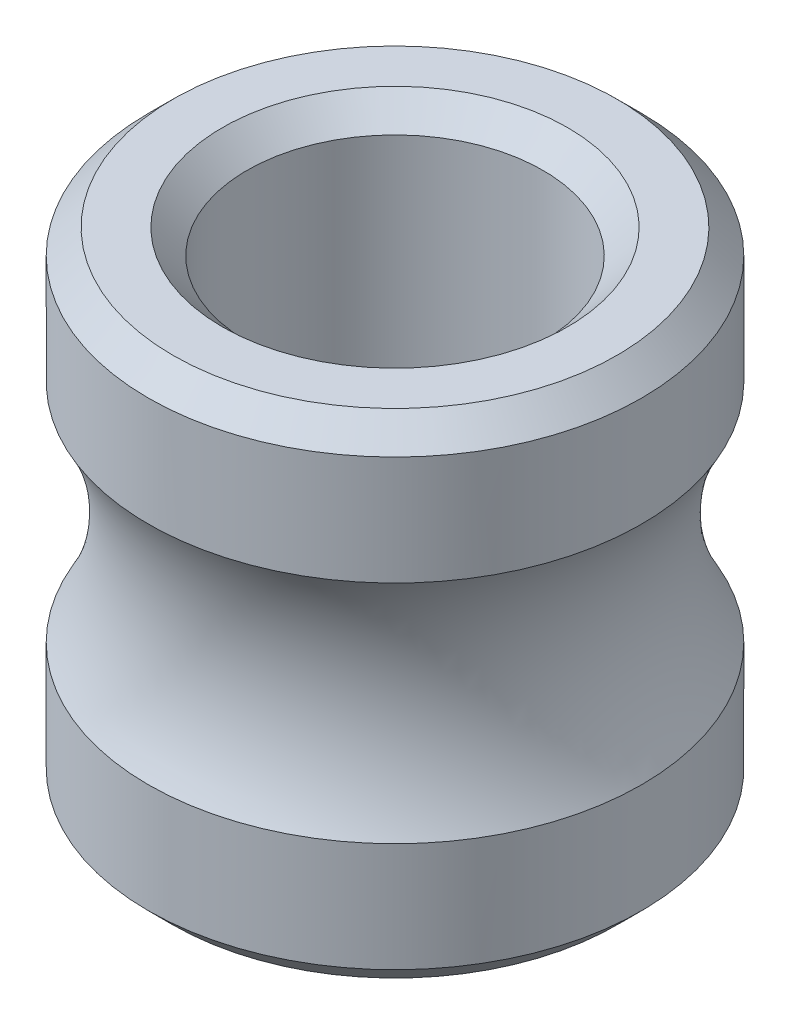
ISO-10303-21;
HEADER;
FILE_DESCRIPTION(('STEP AP214'),'2;1');
FILE_NAME('part.step','',(''),(''),'','','');
FILE_SCHEMA(('AUTOMOTIVE_DESIGN { 1 0 10303 214 1 1 1 1 }'));
ENDSEC;
DATA;
#1=APPLICATION_CONTEXT('core data for automotive mechanical design processes');
#2=APPLICATION_PROTOCOL_DEFINITION('international standard','automotive_design',2000,#1);
#3=PRODUCT_CONTEXT('',#1,'mechanical');
#4=PRODUCT('Part','Part','',(#3));
#5=PRODUCT_RELATED_PRODUCT_CATEGORY('part','',(#4));
#6=PRODUCT_DEFINITION_FORMATION('','',#4);
#7=PRODUCT_DEFINITION_CONTEXT('part definition',#1,'design');
#8=PRODUCT_DEFINITION('design','',#6,#7);
#9=PRODUCT_DEFINITION_SHAPE('','',#8);
#10=(LENGTH_UNIT() NAMED_UNIT(*) SI_UNIT(.MILLI.,.METRE.));
#11=(NAMED_UNIT(*) PLANE_ANGLE_UNIT() SI_UNIT($,.RADIAN.));
#12=(NAMED_UNIT(*) SI_UNIT($,.STERADIAN.) SOLID_ANGLE_UNIT());
#13=UNCERTAINTY_MEASURE_WITH_UNIT(LENGTH_MEASURE(1.E-05),#10,'distance_accuracy_value','');
#14=(GEOMETRIC_REPRESENTATION_CONTEXT(3) GLOBAL_UNCERTAINTY_ASSIGNED_CONTEXT((#13)) GLOBAL_UNIT_ASSIGNED_CONTEXT((#10,
#11,#12)) REPRESENTATION_CONTEXT('',''));
#15=CARTESIAN_POINT('',(0.,0.,0.));
#16=DIRECTION('',(0.,0.,1.));
#17=DIRECTION('',(1.,0.,0.));
#18=AXIS2_PLACEMENT_3D('',#15,#16,#17);
#19=CARTESIAN_POINT('',(0.,2.,0.));
#20=DIRECTION('',(0.,-1.,0.));
#21=DIRECTION('',(0.,0.,-1.));
#22=AXIS2_PLACEMENT_3D('',#19,#20,#21);
#23=CYLINDRICAL_SURFACE('',#22,2.);
#24=CARTESIAN_POINT('',(0.,-0.915150260886157,0.));
#25=DIRECTION('',(0.,1.,0.));
#26=DIRECTION('',(0.,0.,1.));
#27=AXIS2_PLACEMENT_3D('',#24,#25,#26);
#28=CIRCLE('',#27,2.);
#29=CARTESIAN_POINT('',(0.,-0.915150260886157,2.));
#30=VERTEX_POINT('',#29);
#31=EDGE_CURVE('E36',#30,#30,#28,.F.);
#32=ORIENTED_EDGE('',*,*,#31,.T.);
#33=EDGE_LOOP('',(#32));
#34=FACE_BOUND('',#33,.T.);
#35=CARTESIAN_POINT('',(0.,-1.8,0.));
#36=DIRECTION('',(0.,1.,0.));
#37=DIRECTION('',(0.,0.,1.));
#38=AXIS2_PLACEMENT_3D('',#35,#36,#37);
#39=CIRCLE('',#38,2.);
#40=CARTESIAN_POINT('',(0.,-1.8,2.));
#41=VERTEX_POINT('',#40);
#42=EDGE_CURVE('E45',#41,#41,#39,.T.);
#43=ORIENTED_EDGE('',*,*,#42,.T.);
#44=EDGE_LOOP('',(#43));
#45=FACE_BOUND('',#44,.T.);
#46=ADVANCED_FACE('F32',(#34,#45),#23,.T.);
#47=CARTESIAN_POINT('',(0.,2.,0.));
#48=DIRECTION('',(0.,1.,0.));
#49=DIRECTION('',(0.,0.,1.));
#50=AXIS2_PLACEMENT_3D('',#47,#48,#49);
#51=PLANE('',#50);
#52=CARTESIAN_POINT('',(0.,2.,0.));
#53=DIRECTION('',(0.,1.,0.));
#54=DIRECTION('',(0.,0.,1.));
#55=AXIS2_PLACEMENT_3D('',#52,#53,#54);
#56=CIRCLE('',#55,1.8);
#57=CARTESIAN_POINT('',(0.,2.,1.8));
#58=VERTEX_POINT('',#57);
#59=EDGE_CURVE('E10',#58,#58,#56,.T.);
#60=ORIENTED_EDGE('',*,*,#59,.T.);
#61=EDGE_LOOP('',(#60));
#62=FACE_BOUND('',#61,.T.);
#63=CARTESIAN_POINT('',(0.,2.,0.));
#64=DIRECTION('',(0.,1.,0.));
#65=DIRECTION('',(0.,0.,1.));
#66=AXIS2_PLACEMENT_3D('',#63,#64,#65);
#67=CIRCLE('',#66,1.4);
#68=CARTESIAN_POINT('',(0.,2.,1.4));
#69=VERTEX_POINT('',#68);
#70=EDGE_CURVE('E40',#69,#69,#67,.F.);
#71=ORIENTED_EDGE('',*,*,#70,.T.);
#72=EDGE_LOOP('',(#71));
#73=FACE_BOUND('',#72,.T.);
#74=ADVANCED_FACE('F91',(#62,#73),#51,.T.);
#75=CARTESIAN_POINT('',(0.,-2.,0.));
#76=DIRECTION('',(0.,1.,0.));
#77=DIRECTION('',(0.,0.,1.));
#78=AXIS2_PLACEMENT_3D('',#75,#76,#77);
#79=PLANE('',#78);
#80=CARTESIAN_POINT('',(0.,-2.,0.));
#81=DIRECTION('',(0.,1.,0.));
#82=DIRECTION('',(0.,0.,1.));
#83=AXIS2_PLACEMENT_3D('',#80,#81,#82);
#84=CIRCLE('',#83,1.4);
#85=CARTESIAN_POINT('',(0.,-2.,1.4));
#86=VERTEX_POINT('',#85);
#87=EDGE_CURVE('E57',#86,#86,#84,.T.);
#88=ORIENTED_EDGE('',*,*,#87,.T.);
#89=EDGE_LOOP('',(#88));
#90=FACE_BOUND('',#89,.T.);
#91=CARTESIAN_POINT('',(0.,-2.,0.));
#92=DIRECTION('',(0.,1.,0.));
#93=DIRECTION('',(0.,0.,1.));
#94=AXIS2_PLACEMENT_3D('',#91,#92,#93);
#95=CIRCLE('',#94,1.8);
#96=CARTESIAN_POINT('',(0.,-2.,1.8));
#97=VERTEX_POINT('',#96);
#98=EDGE_CURVE('E53',#97,#97,#95,.F.);
#99=ORIENTED_EDGE('',*,*,#98,.T.);
#100=EDGE_LOOP('',(#99));
#101=FACE_BOUND('',#100,.T.);
#102=ADVANCED_FACE('F97',(#90,#101),#79,.F.);
#103=CARTESIAN_POINT('',(0.,0.915150260886157,0.));
#104=DIRECTION('',(0.,-1.,0.));
#105=DIRECTION('',(0.,0.,-1.));
#106=AXIS2_PLACEMENT_3D('',#103,#104,#105);
#107=CIRCLE('',#106,2.);
#108=CARTESIAN_POINT('',(0.,0.915150260886157,-2.));
#109=VERTEX_POINT('',#108);
#110=EDGE_CURVE('E48',#109,#109,#107,.F.);
#111=ORIENTED_EDGE('',*,*,#110,.T.);
#112=EDGE_LOOP('',(#111));
#113=FACE_BOUND('',#112,.T.);
#114=CARTESIAN_POINT('',(0.,1.8,0.));
#115=DIRECTION('',(0.,1.,0.));
#116=DIRECTION('',(0.,0.,1.));
#117=AXIS2_PLACEMENT_3D('',#114,#115,#116);
#118=CIRCLE('',#117,2.);
#119=CARTESIAN_POINT('',(0.,1.8,2.));
#120=VERTEX_POINT('',#119);
#121=EDGE_CURVE('E70',#120,#120,#118,.F.);
#122=ORIENTED_EDGE('',*,*,#121,.T.);
#123=EDGE_LOOP('',(#122));
#124=FACE_BOUND('',#123,.T.);
#125=ADVANCED_FACE('F93',(#113,#124),#23,.T.);
#126=CARTESIAN_POINT('',(0.,2.,0.));
#127=DIRECTION('',(0.,-1.,0.));
#128=DIRECTION('',(0.,0.,-1.));
#129=AXIS2_PLACEMENT_3D('',#126,#127,#128);
#130=CYLINDRICAL_SURFACE('',#129,1.2);
#131=CARTESIAN_POINT('',(0.,-1.8,0.));
#132=DIRECTION('',(0.,1.,0.));
#133=DIRECTION('',(0.,0.,1.));
#134=AXIS2_PLACEMENT_3D('',#131,#132,#133);
#135=CIRCLE('',#134,1.2);
#136=CARTESIAN_POINT('',(0.,-1.8,1.2));
#137=VERTEX_POINT('',#136);
#138=EDGE_CURVE('E67',#137,#137,#135,.F.);
#139=ORIENTED_EDGE('',*,*,#138,.T.);
#140=EDGE_LOOP('',(#139));
#141=FACE_BOUND('',#140,.T.);
#142=CARTESIAN_POINT('',(0.,1.8,0.));
#143=DIRECTION('',(0.,1.,0.));
#144=DIRECTION('',(0.,0.,1.));
#145=AXIS2_PLACEMENT_3D('',#142,#143,#144);
#146=CIRCLE('',#145,1.2);
#147=CARTESIAN_POINT('',(0.,1.8,1.2));
#148=VERTEX_POINT('',#147);
#149=EDGE_CURVE('E62',#148,#148,#146,.T.);
#150=ORIENTED_EDGE('',*,*,#149,.T.);
#151=EDGE_LOOP('',(#150));
#152=FACE_BOUND('',#151,.T.);
#153=ADVANCED_FACE('F87',(#141,#152),#130,.F.);
#154=CARTESIAN_POINT('',(0.,-2.,0.));
#155=DIRECTION('',(0.,-1.,0.));
#156=DIRECTION('',(0.,0.,-1.));
#157=AXIS2_PLACEMENT_3D('',#154,#155,#156);
#158=CONICAL_SURFACE('',#157,1.4,0.785398163397447);
#159=ORIENTED_EDGE('',*,*,#138,.F.);
#160=EDGE_LOOP('',(#159));
#161=FACE_BOUND('',#160,.T.);
#162=ORIENTED_EDGE('',*,*,#87,.F.);
#163=EDGE_LOOP('',(#162));
#164=FACE_BOUND('',#163,.T.);
#165=ADVANCED_FACE('F79',(#161,#164),#158,.F.);
#166=CARTESIAN_POINT('',(0.,-1.8,0.));
#167=DIRECTION('',(0.,1.,0.));
#168=DIRECTION('',(0.,0.,1.));
#169=AXIS2_PLACEMENT_3D('',#166,#167,#168);
#170=CONICAL_SURFACE('',#169,2.,0.785398163397452);
#171=ORIENTED_EDGE('',*,*,#98,.F.);
#172=EDGE_LOOP('',(#171));
#173=FACE_BOUND('',#172,.T.);
#174=ORIENTED_EDGE('',*,*,#42,.F.);
#175=EDGE_LOOP('',(#174));
#176=FACE_BOUND('',#175,.T.);
#177=ADVANCED_FACE('F76',(#173,#176),#170,.T.);
#178=CARTESIAN_POINT('',(0.,2.,0.));
#179=DIRECTION('',(0.,-1.,0.));
#180=DIRECTION('',(0.,0.,-1.));
#181=AXIS2_PLACEMENT_3D('',#178,#179,#180);
#182=CONICAL_SURFACE('',#181,1.8,0.785398163397448);
#183=ORIENTED_EDGE('',*,*,#121,.F.);
#184=EDGE_LOOP('',(#183));
#185=FACE_BOUND('',#184,.T.);
#186=ORIENTED_EDGE('',*,*,#59,.F.);
#187=EDGE_LOOP('',(#186));
#188=FACE_BOUND('',#187,.T.);
#189=ADVANCED_FACE('F78',(#185,#188),#182,.T.);
#190=CARTESIAN_POINT('',(0.,1.8,0.));
#191=DIRECTION('',(0.,1.,0.));
#192=DIRECTION('',(0.,0.,1.));
#193=AXIS2_PLACEMENT_3D('',#190,#191,#192);
#194=CONICAL_SURFACE('',#193,1.2,0.785398163397452);
#195=ORIENTED_EDGE('',*,*,#70,.F.);
#196=EDGE_LOOP('',(#195));
#197=FACE_BOUND('',#196,.T.);
#198=ORIENTED_EDGE('',*,*,#149,.F.);
#199=EDGE_LOOP('',(#198));
#200=FACE_BOUND('',#199,.T.);
#201=ADVANCED_FACE('F34',(#197,#200),#194,.F.);
#202=CARTESIAN_POINT('',(0.,0.,0.));
#203=DIRECTION('',(0.,-1.,0.));
#204=DIRECTION('',(0.,0.,-1.));
#205=AXIS2_PLACEMENT_3D('',#202,#203,#204);
#206=TOROIDAL_SURFACE('',#205,3.55,1.8);
#207=ORIENTED_EDGE('',*,*,#110,.F.);
#208=EDGE_LOOP('',(#207));
#209=FACE_BOUND('',#208,.T.);
#210=ORIENTED_EDGE('',*,*,#31,.F.);
#211=EDGE_LOOP('',(#210));
#212=FACE_BOUND('',#211,.T.);
#213=ADVANCED_FACE('F114',(#209,#212),#206,.F.);
#214=CLOSED_SHELL('',(#46,#74,#102,#125,#153,#165,#177,#189,#201,#213));
#215=MANIFOLD_SOLID_BREP('B2',#214);
#216=ADVANCED_BREP_SHAPE_REPRESENTATION('',(#18,#215),#14);
#217=SHAPE_DEFINITION_REPRESENTATION(#9,#216);
ENDSEC;
END-ISO-10303-21;
